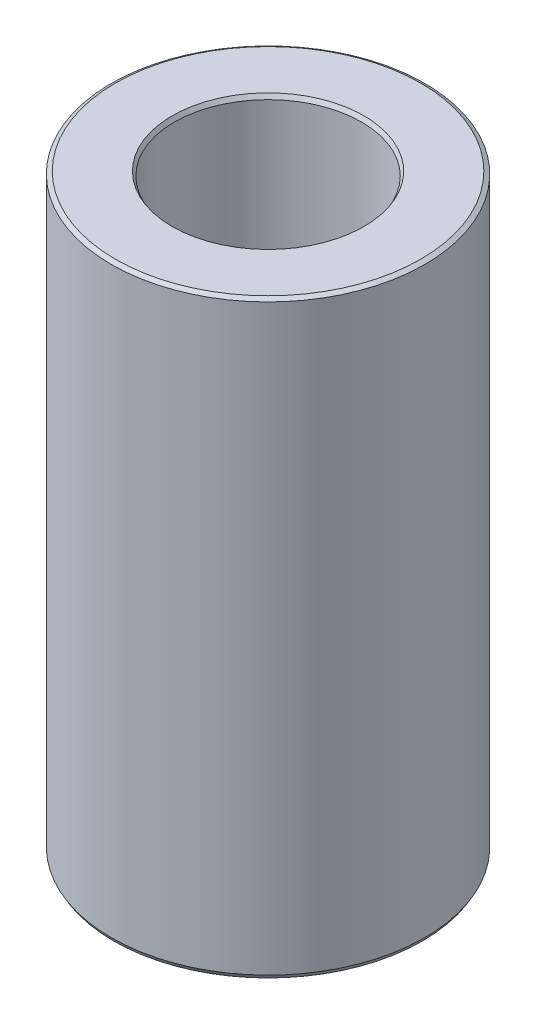
ISO-10303-21;
HEADER;
FILE_DESCRIPTION(('STEP AP214'),'2;1');
FILE_NAME('part.step','',(''),(''),'','','');
FILE_SCHEMA(('AUTOMOTIVE_DESIGN { 1 0 10303 214 1 1 1 1 }'));
ENDSEC;
DATA;
#1=APPLICATION_CONTEXT('core data for automotive mechanical design processes');
#2=APPLICATION_PROTOCOL_DEFINITION('international standard','automotive_design',2000,#1);
#3=PRODUCT_CONTEXT('',#1,'mechanical');
#4=PRODUCT('Part','Part','',(#3));
#5=PRODUCT_RELATED_PRODUCT_CATEGORY('part','',(#4));
#6=PRODUCT_DEFINITION_FORMATION('','',#4);
#7=PRODUCT_DEFINITION_CONTEXT('part definition',#1,'design');
#8=PRODUCT_DEFINITION('design','',#6,#7);
#9=PRODUCT_DEFINITION_SHAPE('','',#8);
#10=(LENGTH_UNIT() NAMED_UNIT(*) SI_UNIT(.MILLI.,.METRE.));
#11=(NAMED_UNIT(*) PLANE_ANGLE_UNIT() SI_UNIT($,.RADIAN.));
#12=(NAMED_UNIT(*) SI_UNIT($,.STERADIAN.) SOLID_ANGLE_UNIT());
#13=UNCERTAINTY_MEASURE_WITH_UNIT(LENGTH_MEASURE(1.E-05),#10,'distance_accuracy_value','');
#14=(GEOMETRIC_REPRESENTATION_CONTEXT(3) GLOBAL_UNCERTAINTY_ASSIGNED_CONTEXT((#13)) GLOBAL_UNIT_ASSIGNED_CONTEXT((#10,
#11,#12)) REPRESENTATION_CONTEXT('',''));
#15=CARTESIAN_POINT('',(0.,0.,0.));
#16=DIRECTION('',(0.,0.,1.));
#17=DIRECTION('',(1.,0.,0.));
#18=AXIS2_PLACEMENT_3D('',#15,#16,#17);
#19=CARTESIAN_POINT('',(0.,169.229643277129,0.));
#20=DIRECTION('',(0.,-1.,0.));
#21=DIRECTION('',(0.,0.,-1.));
#22=AXIS2_PLACEMENT_3D('',#19,#20,#21);
#23=CYLINDRICAL_SURFACE('',#22,45.);
#24=CARTESIAN_POINT('',(0.,1.19775039605957,0.));
#25=DIRECTION('',(0.,1.,0.));
#26=DIRECTION('',(0.,0.,1.));
#27=AXIS2_PLACEMENT_3D('',#24,#25,#26);
#28=CIRCLE('',#27,45.);
#29=CARTESIAN_POINT('',(0.,1.19775039605957,45.));
#30=VERTEX_POINT('',#29);
#31=EDGE_CURVE('E10',#30,#30,#28,.T.);
#32=ORIENTED_EDGE('',*,*,#31,.T.);
#33=EDGE_LOOP('',(#32));
#34=FACE_BOUND('',#33,.T.);
#35=CARTESIAN_POINT('',(0.,168.538121763542,0.));
#36=DIRECTION('',(0.,1.,0.));
#37=DIRECTION('',(0.,0.,1.));
#38=AXIS2_PLACEMENT_3D('',#35,#36,#37);
#39=CIRCLE('',#38,45.);
#40=CARTESIAN_POINT('',(0.,168.538121763542,45.));
#41=VERTEX_POINT('',#40);
#42=EDGE_CURVE('E50',#41,#41,#39,.F.);
#43=ORIENTED_EDGE('',*,*,#42,.T.);
#44=EDGE_LOOP('',(#43));
#45=FACE_BOUND('',#44,.T.);
#46=ADVANCED_FACE('F39',(#34,#45),#23,.T.);
#47=CARTESIAN_POINT('',(0.,169.229643277129,0.));
#48=DIRECTION('',(0.,1.,0.));
#49=DIRECTION('',(0.,0.,1.));
#50=AXIS2_PLACEMENT_3D('',#47,#48,#49);
#51=PLANE('',#50);
#52=CARTESIAN_POINT('',(0.,169.229643277129,0.));
#53=DIRECTION('',(0.,1.,0.));
#54=DIRECTION('',(0.,0.,1.));
#55=AXIS2_PLACEMENT_3D('',#52,#53,#54);
#56=CIRCLE('',#55,27.5348711600629);
#57=CARTESIAN_POINT('',(0.,169.229643277129,27.5348711600629));
#58=VERTEX_POINT('',#57);
#59=EDGE_CURVE('E58',#58,#58,#56,.F.);
#60=ORIENTED_EDGE('',*,*,#59,.T.);
#61=EDGE_LOOP('',(#60));
#62=FACE_BOUND('',#61,.T.);
#63=CARTESIAN_POINT('',(0.,169.229643277129,0.));
#64=DIRECTION('',(0.,1.,0.));
#65=DIRECTION('',(0.,0.,1.));
#66=AXIS2_PLACEMENT_3D('',#63,#64,#65);
#67=CIRCLE('',#66,43.8022496039404);
#68=CARTESIAN_POINT('',(0.,169.229643277129,43.8022496039404));
#69=VERTEX_POINT('',#68);
#70=EDGE_CURVE('E61',#69,#69,#67,.T.);
#71=ORIENTED_EDGE('',*,*,#70,.T.);
#72=EDGE_LOOP('',(#71));
#73=FACE_BOUND('',#72,.T.);
#74=ADVANCED_FACE('F88',(#62,#73),#51,.T.);
#75=CARTESIAN_POINT('',(0.,0.,0.));
#76=DIRECTION('',(0.,1.,0.));
#77=DIRECTION('',(0.,0.,1.));
#78=AXIS2_PLACEMENT_3D('',#75,#76,#77);
#79=PLANE('',#78);
#80=CARTESIAN_POINT('',(0.,0.,0.));
#81=DIRECTION('',(0.,1.,0.));
#82=DIRECTION('',(0.,0.,1.));
#83=AXIS2_PLACEMENT_3D('',#80,#81,#82);
#84=CIRCLE('',#83,28.0411000425355);
#85=CARTESIAN_POINT('',(0.,0.,28.0411000425355));
#86=VERTEX_POINT('',#85);
#87=EDGE_CURVE('E51',#86,#86,#84,.T.);
#88=ORIENTED_EDGE('',*,*,#87,.T.);
#89=EDGE_LOOP('',(#88));
#90=FACE_BOUND('',#89,.T.);
#91=CARTESIAN_POINT('',(0.,0.,0.));
#92=DIRECTION('',(0.,1.,0.));
#93=DIRECTION('',(0.,0.,1.));
#94=AXIS2_PLACEMENT_3D('',#91,#92,#93);
#95=CIRCLE('',#94,44.308478486413);
#96=CARTESIAN_POINT('',(0.,0.,44.308478486413));
#97=VERTEX_POINT('',#96);
#98=EDGE_CURVE('E54',#97,#97,#95,.F.);
#99=ORIENTED_EDGE('',*,*,#98,.T.);
#100=EDGE_LOOP('',(#99));
#101=FACE_BOUND('',#100,.T.);
#102=ADVANCED_FACE('F83',(#90,#101),#79,.F.);
#103=CARTESIAN_POINT('',(0.,169.229643277129,0.));
#104=DIRECTION('',(0.,-1.,0.));
#105=DIRECTION('',(0.,0.,-1.));
#106=AXIS2_PLACEMENT_3D('',#103,#104,#105);
#107=CYLINDRICAL_SURFACE('',#106,26.8433496464759);
#108=CARTESIAN_POINT('',(0.,168.031892881069,0.));
#109=DIRECTION('',(0.,1.,0.));
#110=DIRECTION('',(0.,0.,1.));
#111=AXIS2_PLACEMENT_3D('',#108,#109,#110);
#112=CIRCLE('',#111,26.8433496464759);
#113=CARTESIAN_POINT('',(0.,168.031892881069,26.8433496464759));
#114=VERTEX_POINT('',#113);
#115=EDGE_CURVE('E67',#114,#114,#112,.T.);
#116=ORIENTED_EDGE('',*,*,#115,.T.);
#117=EDGE_LOOP('',(#116));
#118=FACE_BOUND('',#117,.T.);
#119=CARTESIAN_POINT('',(0.,0.691521513587007,0.));
#120=DIRECTION('',(0.,1.,0.));
#121=DIRECTION('',(0.,0.,1.));
#122=AXIS2_PLACEMENT_3D('',#119,#120,#121);
#123=CIRCLE('',#122,26.8433496464759);
#124=CARTESIAN_POINT('',(0.,0.691521513587007,26.8433496464759));
#125=VERTEX_POINT('',#124);
#126=EDGE_CURVE('E69',#125,#125,#123,.F.);
#127=ORIENTED_EDGE('',*,*,#126,.T.);
#128=EDGE_LOOP('',(#127));
#129=FACE_BOUND('',#128,.T.);
#130=ADVANCED_FACE('F71',(#118,#129),#107,.F.);
#131=CARTESIAN_POINT('',(0.,168.031892881069,0.));
#132=DIRECTION('',(0.,1.,0.));
#133=DIRECTION('',(0.,0.,1.));
#134=AXIS2_PLACEMENT_3D('',#131,#132,#133);
#135=CONICAL_SURFACE('',#134,26.8433496464759,0.523598775598292);
#136=ORIENTED_EDGE('',*,*,#59,.F.);
#137=EDGE_LOOP('',(#136));
#138=FACE_BOUND('',#137,.T.);
#139=ORIENTED_EDGE('',*,*,#115,.F.);
#140=EDGE_LOOP('',(#139));
#141=FACE_BOUND('',#140,.T.);
#142=ADVANCED_FACE('F77',(#138,#141),#135,.F.);
#143=CARTESIAN_POINT('',(0.,0.,0.));
#144=DIRECTION('',(0.,-1.,0.));
#145=DIRECTION('',(0.,0.,-1.));
#146=AXIS2_PLACEMENT_3D('',#143,#144,#145);
#147=CONICAL_SURFACE('',#146,28.0411000425355,1.04719755119658);
#148=ORIENTED_EDGE('',*,*,#126,.F.);
#149=EDGE_LOOP('',(#148));
#150=FACE_BOUND('',#149,.T.);
#151=ORIENTED_EDGE('',*,*,#87,.F.);
#152=EDGE_LOOP('',(#151));
#153=FACE_BOUND('',#152,.T.);
#154=ADVANCED_FACE('F73',(#150,#153),#147,.F.);
#155=CARTESIAN_POINT('',(0.,1.19775039605957,0.));
#156=DIRECTION('',(0.,1.,0.));
#157=DIRECTION('',(0.,0.,1.));
#158=AXIS2_PLACEMENT_3D('',#155,#156,#157);
#159=CONICAL_SURFACE('',#158,45.,0.523598775598302);
#160=ORIENTED_EDGE('',*,*,#98,.F.);
#161=EDGE_LOOP('',(#160));
#162=FACE_BOUND('',#161,.T.);
#163=ORIENTED_EDGE('',*,*,#31,.F.);
#164=EDGE_LOOP('',(#163));
#165=FACE_BOUND('',#164,.T.);
#166=ADVANCED_FACE('F76',(#162,#165),#159,.T.);
#167=CARTESIAN_POINT('',(0.,169.229643277129,0.));
#168=DIRECTION('',(0.,-1.,0.));
#169=DIRECTION('',(0.,0.,-1.));
#170=AXIS2_PLACEMENT_3D('',#167,#168,#169);
#171=CONICAL_SURFACE('',#170,43.8022496039404,1.0471975511966);
#172=ORIENTED_EDGE('',*,*,#42,.F.);
#173=EDGE_LOOP('',(#172));
#174=FACE_BOUND('',#173,.T.);
#175=ORIENTED_EDGE('',*,*,#70,.F.);
#176=EDGE_LOOP('',(#175));
#177=FACE_BOUND('',#176,.T.);
#178=ADVANCED_FACE('F45',(#174,#177),#171,.T.);
#179=CLOSED_SHELL('',(#46,#74,#102,#130,#142,#154,#166,#178));
#180=MANIFOLD_SOLID_BREP('B2',#179);
#181=ADVANCED_BREP_SHAPE_REPRESENTATION('',(#18,#180),#14);
#182=SHAPE_DEFINITION_REPRESENTATION(#9,#181);
ENDSEC;
END-ISO-10303-21;
